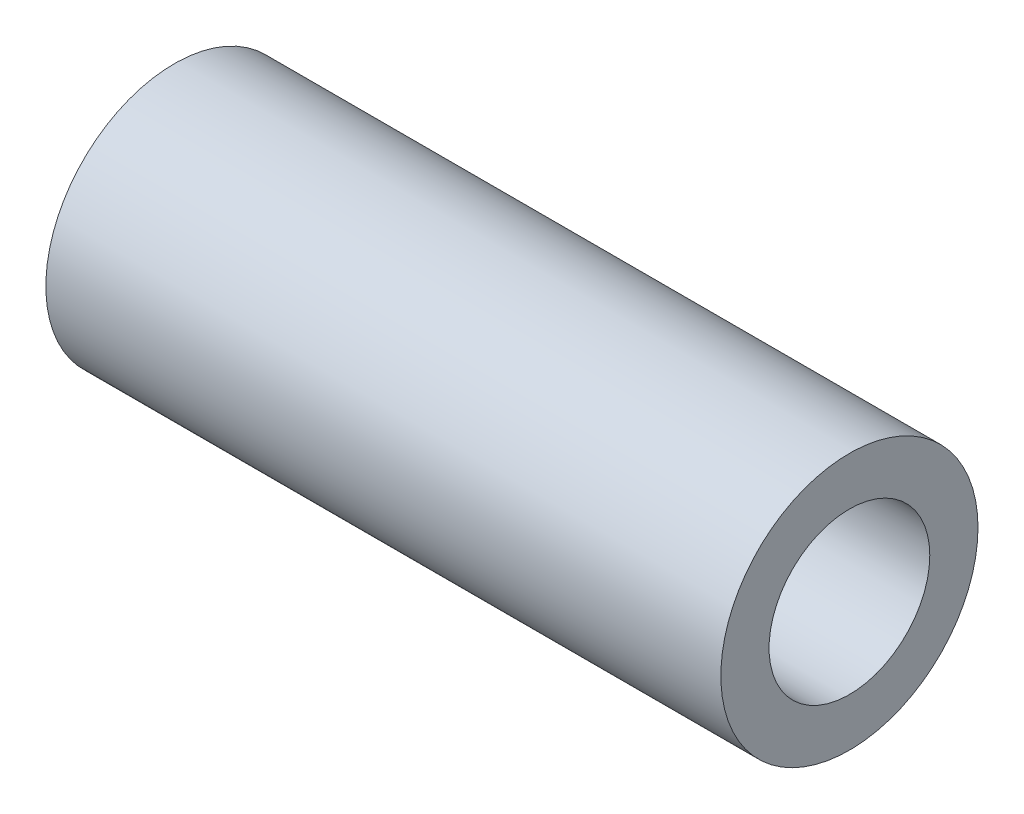
ISO-10303-21;
HEADER;
FILE_DESCRIPTION(('STEP AP214'),'2;1');
FILE_NAME('part.step','',(''),(''),'','','');
FILE_SCHEMA(('AUTOMOTIVE_DESIGN { 1 0 10303 214 1 1 1 1 }'));
ENDSEC;
DATA;
#1=APPLICATION_CONTEXT('core data for automotive mechanical design processes');
#2=APPLICATION_PROTOCOL_DEFINITION('international standard','automotive_design',2000,#1);
#3=PRODUCT_CONTEXT('',#1,'mechanical');
#4=PRODUCT('Part','Part','',(#3));
#5=PRODUCT_RELATED_PRODUCT_CATEGORY('part','',(#4));
#6=PRODUCT_DEFINITION_FORMATION('','',#4);
#7=PRODUCT_DEFINITION_CONTEXT('part definition',#1,'design');
#8=PRODUCT_DEFINITION('design','',#6,#7);
#9=PRODUCT_DEFINITION_SHAPE('','',#8);
#10=(LENGTH_UNIT() NAMED_UNIT(*) SI_UNIT(.MILLI.,.METRE.));
#11=(NAMED_UNIT(*) PLANE_ANGLE_UNIT() SI_UNIT($,.RADIAN.));
#12=(NAMED_UNIT(*) SI_UNIT($,.STERADIAN.) SOLID_ANGLE_UNIT());
#13=UNCERTAINTY_MEASURE_WITH_UNIT(LENGTH_MEASURE(1.E-05),#10,'distance_accuracy_value','');
#14=(GEOMETRIC_REPRESENTATION_CONTEXT(3) GLOBAL_UNCERTAINTY_ASSIGNED_CONTEXT((#13)) GLOBAL_UNIT_ASSIGNED_CONTEXT((#10,
#11,#12)) REPRESENTATION_CONTEXT('',''));
#15=CARTESIAN_POINT('',(0.,0.,0.));
#16=DIRECTION('',(0.,0.,1.));
#17=DIRECTION('',(1.,0.,0.));
#18=AXIS2_PLACEMENT_3D('',#15,#16,#17);
#19=CARTESIAN_POINT('',(10.5,0.,0.));
#20=DIRECTION('',(1.,0.,0.));
#21=DIRECTION('',(0.,0.,-1.));
#22=AXIS2_PLACEMENT_3D('',#19,#20,#21);
#23=PLANE('',#22);
#24=CARTESIAN_POINT('',(10.5,0.,0.));
#25=DIRECTION('',(1.,0.,0.));
#26=DIRECTION('',(0.,0.,-1.));
#27=AXIS2_PLACEMENT_3D('',#24,#25,#26);
#28=CIRCLE('',#27,4.);
#29=CARTESIAN_POINT('',(10.5,0.,-4.));
#30=VERTEX_POINT('',#29);
#31=EDGE_CURVE('E10',#30,#30,#28,.T.);
#32=ORIENTED_EDGE('',*,*,#31,.T.);
#33=EDGE_LOOP('',(#32));
#34=FACE_BOUND('',#33,.T.);
#35=CARTESIAN_POINT('',(10.5,0.,0.));
#36=DIRECTION('',(1.,0.,0.));
#37=DIRECTION('',(0.,0.,-1.));
#38=AXIS2_PLACEMENT_3D('',#35,#36,#37);
#39=CIRCLE('',#38,2.5);
#40=CARTESIAN_POINT('',(10.5,0.,-2.5));
#41=VERTEX_POINT('',#40);
#42=EDGE_CURVE('E43',#41,#41,#39,.T.);
#43=ORIENTED_EDGE('',*,*,#42,.F.);
#44=EDGE_LOOP('',(#43));
#45=FACE_BOUND('',#44,.T.);
#46=ADVANCED_FACE('F32',(#34,#45),#23,.T.);
#47=CARTESIAN_POINT('',(-10.5,0.,0.));
#48=DIRECTION('',(1.,0.,0.));
#49=DIRECTION('',(0.,0.,-1.));
#50=AXIS2_PLACEMENT_3D('',#47,#48,#49);
#51=PLANE('',#50);
#52=CARTESIAN_POINT('',(-10.5,0.,0.));
#53=DIRECTION('',(1.,0.,0.));
#54=DIRECTION('',(0.,0.,-1.));
#55=AXIS2_PLACEMENT_3D('',#52,#53,#54);
#56=CIRCLE('',#55,4.);
#57=CARTESIAN_POINT('',(-10.5,0.,-4.));
#58=VERTEX_POINT('',#57);
#59=EDGE_CURVE('E36',#58,#58,#56,.T.);
#60=ORIENTED_EDGE('',*,*,#59,.F.);
#61=EDGE_LOOP('',(#60));
#62=FACE_BOUND('',#61,.T.);
#63=CARTESIAN_POINT('',(-10.5,0.,0.));
#64=DIRECTION('',(1.,0.,0.));
#65=DIRECTION('',(0.,0.,-1.));
#66=AXIS2_PLACEMENT_3D('',#63,#64,#65);
#67=CIRCLE('',#66,2.5);
#68=CARTESIAN_POINT('',(-10.5,0.,-2.5));
#69=VERTEX_POINT('',#68);
#70=EDGE_CURVE('E45',#69,#69,#67,.T.);
#71=ORIENTED_EDGE('',*,*,#70,.T.);
#72=EDGE_LOOP('',(#71));
#73=FACE_BOUND('',#72,.T.);
#74=ADVANCED_FACE('F55',(#62,#73),#51,.F.);
#75=CARTESIAN_POINT('',(10.5,0.,0.));
#76=DIRECTION('',(-1.,0.,0.));
#77=DIRECTION('',(0.,0.,1.));
#78=AXIS2_PLACEMENT_3D('',#75,#76,#77);
#79=CYLINDRICAL_SURFACE('',#78,4.);
#80=ORIENTED_EDGE('',*,*,#31,.F.);
#81=EDGE_LOOP('',(#80));
#82=FACE_BOUND('',#81,.T.);
#83=ORIENTED_EDGE('',*,*,#59,.T.);
#84=EDGE_LOOP('',(#83));
#85=FACE_BOUND('',#84,.T.);
#86=ADVANCED_FACE('F34',(#82,#85),#79,.T.);
#87=CARTESIAN_POINT('',(10.5,0.,0.));
#88=DIRECTION('',(-1.,0.,0.));
#89=DIRECTION('',(0.,0.,1.));
#90=AXIS2_PLACEMENT_3D('',#87,#88,#89);
#91=CYLINDRICAL_SURFACE('',#90,2.5);
#92=ORIENTED_EDGE('',*,*,#42,.T.);
#93=EDGE_LOOP('',(#92));
#94=FACE_BOUND('',#93,.T.);
#95=ORIENTED_EDGE('',*,*,#70,.F.);
#96=EDGE_LOOP('',(#95));
#97=FACE_BOUND('',#96,.T.);
#98=ADVANCED_FACE('F51',(#94,#97),#91,.F.);
#99=CLOSED_SHELL('',(#46,#74,#86,#98));
#100=MANIFOLD_SOLID_BREP('B2',#99);
#101=ADVANCED_BREP_SHAPE_REPRESENTATION('',(#18,#100),#14);
#102=SHAPE_DEFINITION_REPRESENTATION(#9,#101);
ENDSEC;
END-ISO-10303-21;
